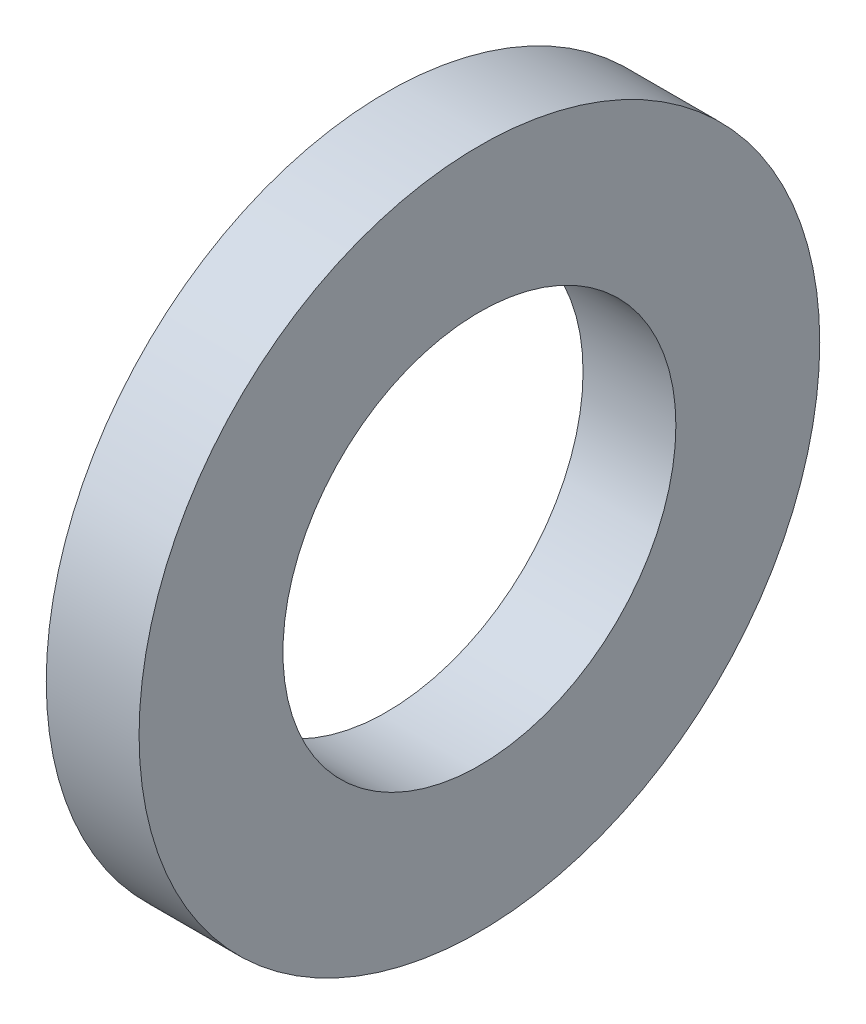
ISO-10303-21;
HEADER;
FILE_DESCRIPTION(('STEP AP214'),'2;1');
FILE_NAME('part.step','',(''),(''),'','','');
FILE_SCHEMA(('AUTOMOTIVE_DESIGN { 1 0 10303 214 1 1 1 1 }'));
ENDSEC;
DATA;
#1=APPLICATION_CONTEXT('core data for automotive mechanical design processes');
#2=APPLICATION_PROTOCOL_DEFINITION('international standard','automotive_design',2000,#1);
#3=PRODUCT_CONTEXT('',#1,'mechanical');
#4=PRODUCT('Part','Part','',(#3));
#5=PRODUCT_RELATED_PRODUCT_CATEGORY('part','',(#4));
#6=PRODUCT_DEFINITION_FORMATION('','',#4);
#7=PRODUCT_DEFINITION_CONTEXT('part definition',#1,'design');
#8=PRODUCT_DEFINITION('design','',#6,#7);
#9=PRODUCT_DEFINITION_SHAPE('','',#8);
#10=(LENGTH_UNIT() NAMED_UNIT(*) SI_UNIT(.MILLI.,.METRE.));
#11=(NAMED_UNIT(*) PLANE_ANGLE_UNIT() SI_UNIT($,.RADIAN.));
#12=(NAMED_UNIT(*) SI_UNIT($,.STERADIAN.) SOLID_ANGLE_UNIT());
#13=UNCERTAINTY_MEASURE_WITH_UNIT(LENGTH_MEASURE(1.E-05),#10,'distance_accuracy_value','');
#14=(GEOMETRIC_REPRESENTATION_CONTEXT(3) GLOBAL_UNCERTAINTY_ASSIGNED_CONTEXT((#13)) GLOBAL_UNIT_ASSIGNED_CONTEXT((#10,
#11,#12)) REPRESENTATION_CONTEXT('',''));
#15=CARTESIAN_POINT('',(0.,0.,0.));
#16=DIRECTION('',(0.,0.,1.));
#17=DIRECTION('',(1.,0.,0.));
#18=AXIS2_PLACEMENT_3D('',#15,#16,#17);
#19=CARTESIAN_POINT('',(-1.5,0.,0.));
#20=DIRECTION('',(1.,0.,0.));
#21=DIRECTION('',(0.,0.,-1.));
#22=AXIS2_PLACEMENT_3D('',#19,#20,#21);
#23=CYLINDRICAL_SURFACE('',#22,11.);
#24=CARTESIAN_POINT('',(-1.5,0.,0.));
#25=DIRECTION('',(1.,0.,0.));
#26=DIRECTION('',(0.,0.,-1.));
#27=AXIS2_PLACEMENT_3D('',#24,#25,#26);
#28=CIRCLE('',#27,11.);
#29=CARTESIAN_POINT('',(-1.5,0.,-11.));
#30=VERTEX_POINT('',#29);
#31=EDGE_CURVE('E10',#30,#30,#28,.T.);
#32=ORIENTED_EDGE('',*,*,#31,.T.);
#33=EDGE_LOOP('',(#32));
#34=FACE_BOUND('',#33,.T.);
#35=CARTESIAN_POINT('',(1.5,0.,0.));
#36=DIRECTION('',(1.,0.,0.));
#37=DIRECTION('',(0.,0.,-1.));
#38=AXIS2_PLACEMENT_3D('',#35,#36,#37);
#39=CIRCLE('',#38,11.);
#40=CARTESIAN_POINT('',(1.5,0.,-11.));
#41=VERTEX_POINT('',#40);
#42=EDGE_CURVE('E40',#41,#41,#39,.T.);
#43=ORIENTED_EDGE('',*,*,#42,.F.);
#44=EDGE_LOOP('',(#43));
#45=FACE_BOUND('',#44,.T.);
#46=ADVANCED_FACE('F30',(#34,#45),#23,.T.);
#47=CARTESIAN_POINT('',(-1.5,0.,0.));
#48=DIRECTION('',(1.,0.,0.));
#49=DIRECTION('',(0.,0.,-1.));
#50=AXIS2_PLACEMENT_3D('',#47,#48,#49);
#51=PLANE('',#50);
#52=CARTESIAN_POINT('',(-1.5,0.,0.));
#53=DIRECTION('',(1.,0.,0.));
#54=DIRECTION('',(0.,0.,-1.));
#55=AXIS2_PLACEMENT_3D('',#52,#53,#54);
#56=CIRCLE('',#55,6.35);
#57=CARTESIAN_POINT('',(-1.5,0.,-6.35));
#58=VERTEX_POINT('',#57);
#59=EDGE_CURVE('E36',#58,#58,#56,.T.);
#60=ORIENTED_EDGE('',*,*,#59,.T.);
#61=EDGE_LOOP('',(#60));
#62=FACE_BOUND('',#61,.T.);
#63=ORIENTED_EDGE('',*,*,#31,.F.);
#64=EDGE_LOOP('',(#63));
#65=FACE_BOUND('',#64,.T.);
#66=ADVANCED_FACE('F59',(#62,#65),#51,.F.);
#67=CARTESIAN_POINT('',(-1.5,0.,0.));
#68=DIRECTION('',(1.,0.,0.));
#69=DIRECTION('',(0.,0.,-1.));
#70=AXIS2_PLACEMENT_3D('',#67,#68,#69);
#71=CYLINDRICAL_SURFACE('',#70,6.35);
#72=ORIENTED_EDGE('',*,*,#59,.F.);
#73=EDGE_LOOP('',(#72));
#74=FACE_BOUND('',#73,.T.);
#75=CARTESIAN_POINT('',(1.5,0.,0.));
#76=DIRECTION('',(1.,0.,0.));
#77=DIRECTION('',(0.,0.,-1.));
#78=AXIS2_PLACEMENT_3D('',#75,#76,#77);
#79=CIRCLE('',#78,6.35);
#80=CARTESIAN_POINT('',(1.5,0.,-6.35));
#81=VERTEX_POINT('',#80);
#82=EDGE_CURVE('E44',#81,#81,#79,.T.);
#83=ORIENTED_EDGE('',*,*,#82,.T.);
#84=EDGE_LOOP('',(#83));
#85=FACE_BOUND('',#84,.T.);
#86=ADVANCED_FACE('F50',(#74,#85),#71,.F.);
#87=CARTESIAN_POINT('',(1.5,0.,0.));
#88=DIRECTION('',(1.,0.,0.));
#89=DIRECTION('',(0.,0.,-1.));
#90=AXIS2_PLACEMENT_3D('',#87,#88,#89);
#91=PLANE('',#90);
#92=ORIENTED_EDGE('',*,*,#42,.T.);
#93=EDGE_LOOP('',(#92));
#94=FACE_BOUND('',#93,.T.);
#95=ORIENTED_EDGE('',*,*,#82,.F.);
#96=EDGE_LOOP('',(#95));
#97=FACE_BOUND('',#96,.T.);
#98=ADVANCED_FACE('F52',(#94,#97),#91,.T.);
#99=CLOSED_SHELL('',(#46,#66,#86,#98));
#100=MANIFOLD_SOLID_BREP('B2',#99);
#101=ADVANCED_BREP_SHAPE_REPRESENTATION('',(#18,#100),#14);
#102=SHAPE_DEFINITION_REPRESENTATION(#9,#101);
ENDSEC;
END-ISO-10303-21;
